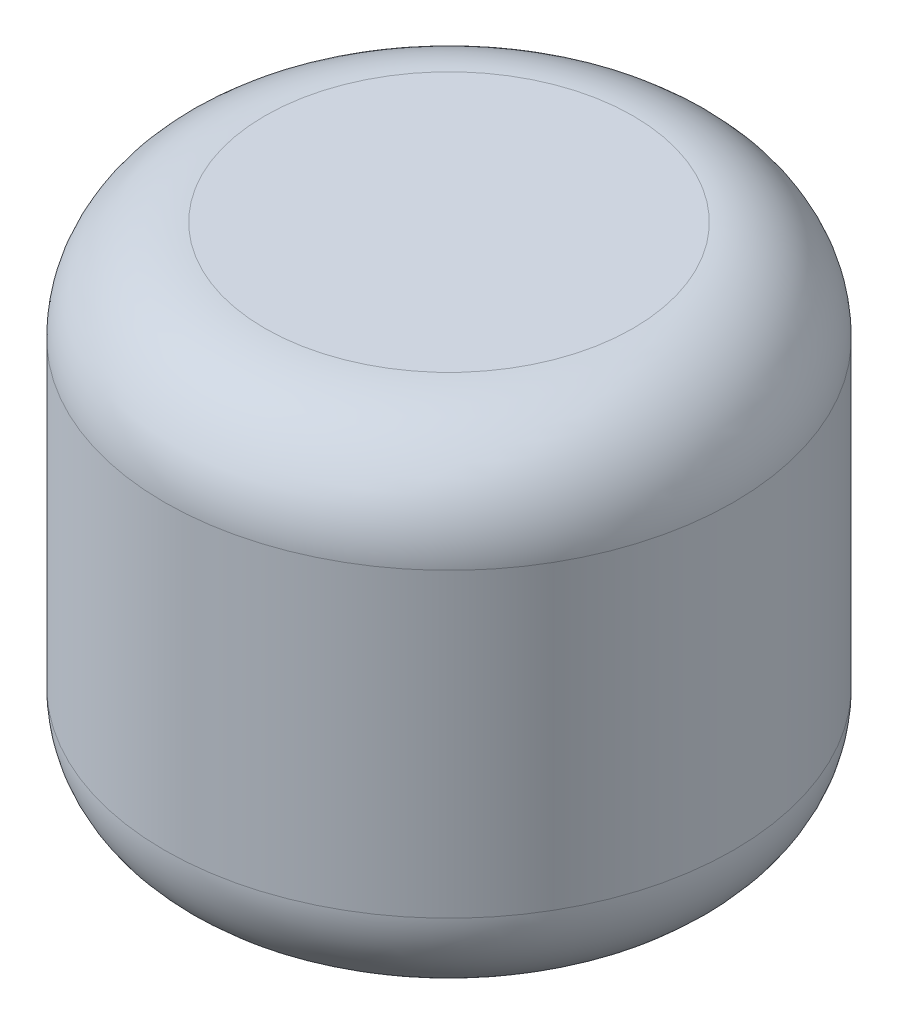
ISO-10303-21;
HEADER;
FILE_DESCRIPTION(('STEP AP214'),'2;1');
FILE_NAME('part.step','',(''),(''),'','','');
FILE_SCHEMA(('AUTOMOTIVE_DESIGN { 1 0 10303 214 1 1 1 1 }'));
ENDSEC;
DATA;
#1=APPLICATION_CONTEXT('core data for automotive mechanical design processes');
#2=APPLICATION_PROTOCOL_DEFINITION('international standard','automotive_design',2000,#1);
#3=PRODUCT_CONTEXT('',#1,'mechanical');
#4=PRODUCT('Part','Part','',(#3));
#5=PRODUCT_RELATED_PRODUCT_CATEGORY('part','',(#4));
#6=PRODUCT_DEFINITION_FORMATION('','',#4);
#7=PRODUCT_DEFINITION_CONTEXT('part definition',#1,'design');
#8=PRODUCT_DEFINITION('design','',#6,#7);
#9=PRODUCT_DEFINITION_SHAPE('','',#8);
#10=(LENGTH_UNIT() NAMED_UNIT(*) SI_UNIT(.MILLI.,.METRE.));
#11=(NAMED_UNIT(*) PLANE_ANGLE_UNIT() SI_UNIT($,.RADIAN.));
#12=(NAMED_UNIT(*) SI_UNIT($,.STERADIAN.) SOLID_ANGLE_UNIT());
#13=UNCERTAINTY_MEASURE_WITH_UNIT(LENGTH_MEASURE(1.E-05),#10,'distance_accuracy_value','');
#14=(GEOMETRIC_REPRESENTATION_CONTEXT(3) GLOBAL_UNCERTAINTY_ASSIGNED_CONTEXT((#13)) GLOBAL_UNIT_ASSIGNED_CONTEXT((#10,
#11,#12)) REPRESENTATION_CONTEXT('',''));
#15=CARTESIAN_POINT('',(0.,0.,0.));
#16=DIRECTION('',(0.,0.,1.));
#17=DIRECTION('',(1.,0.,0.));
#18=AXIS2_PLACEMENT_3D('',#15,#16,#17);
#19=CARTESIAN_POINT('',(0.,15.,0.));
#20=DIRECTION('',(0.,-1.,0.));
#21=DIRECTION('',(0.,0.,-1.));
#22=AXIS2_PLACEMENT_3D('',#19,#20,#21);
#23=CYLINDRICAL_SURFACE('',#22,8.5);
#24=CARTESIAN_POINT('',(0.,3.,0.));
#25=DIRECTION('',(0.,1.,0.));
#26=DIRECTION('',(0.,0.,1.));
#27=AXIS2_PLACEMENT_3D('',#24,#25,#26);
#28=CIRCLE('',#27,8.5);
#29=CARTESIAN_POINT('',(0.,3.,8.5));
#30=VERTEX_POINT('',#29);
#31=EDGE_CURVE('E44',#30,#30,#28,.T.);
#32=ORIENTED_EDGE('',*,*,#31,.T.);
#33=EDGE_LOOP('',(#32));
#34=FACE_BOUND('',#33,.T.);
#35=CARTESIAN_POINT('',(0.,12.,0.));
#36=DIRECTION('',(0.,1.,0.));
#37=DIRECTION('',(0.,0.,1.));
#38=AXIS2_PLACEMENT_3D('',#35,#36,#37);
#39=CIRCLE('',#38,8.5);
#40=CARTESIAN_POINT('',(0.,12.,8.5));
#41=VERTEX_POINT('',#40);
#42=EDGE_CURVE('E48',#41,#41,#39,.F.);
#43=ORIENTED_EDGE('',*,*,#42,.T.);
#44=EDGE_LOOP('',(#43));
#45=FACE_BOUND('',#44,.T.);
#46=ADVANCED_FACE('F33',(#34,#45),#23,.T.);
#47=CARTESIAN_POINT('',(0.,15.,0.));
#48=DIRECTION('',(0.,1.,0.));
#49=DIRECTION('',(0.,0.,1.));
#50=AXIS2_PLACEMENT_3D('',#47,#48,#49);
#51=PLANE('',#50);
#52=CARTESIAN_POINT('',(0.,15.,0.));
#53=DIRECTION('',(0.,1.,0.));
#54=DIRECTION('',(0.,0.,1.));
#55=AXIS2_PLACEMENT_3D('',#52,#53,#54);
#56=CIRCLE('',#55,5.5);
#57=CARTESIAN_POINT('',(0.,15.,5.5));
#58=VERTEX_POINT('',#57);
#59=EDGE_CURVE('E10',#58,#58,#56,.T.);
#60=ORIENTED_EDGE('',*,*,#59,.T.);
#61=EDGE_LOOP('',(#60));
#62=FACE_BOUND('',#61,.T.);
#63=ADVANCED_FACE('F70',(#62),#51,.T.);
#64=CARTESIAN_POINT('',(0.,0.,0.));
#65=DIRECTION('',(0.,1.,0.));
#66=DIRECTION('',(0.,0.,1.));
#67=AXIS2_PLACEMENT_3D('',#64,#65,#66);
#68=PLANE('',#67);
#69=CARTESIAN_POINT('',(0.,0.,0.));
#70=DIRECTION('',(0.,1.,0.));
#71=DIRECTION('',(0.,0.,1.));
#72=AXIS2_PLACEMENT_3D('',#69,#70,#71);
#73=CIRCLE('',#72,5.5);
#74=CARTESIAN_POINT('',(0.,0.,5.5));
#75=VERTEX_POINT('',#74);
#76=EDGE_CURVE('E40',#75,#75,#73,.F.);
#77=ORIENTED_EDGE('',*,*,#76,.T.);
#78=EDGE_LOOP('',(#77));
#79=FACE_BOUND('',#78,.T.);
#80=CARTESIAN_POINT('',(0.,0.,0.));
#81=DIRECTION('',(0.,-1.,0.));
#82=DIRECTION('',(0.,0.,-1.));
#83=AXIS2_PLACEMENT_3D('',#80,#81,#82);
#84=CIRCLE('',#83,3.5);
#85=CARTESIAN_POINT('',(0.,0.,-3.5));
#86=VERTEX_POINT('',#85);
#87=EDGE_CURVE('E54',#86,#86,#84,.T.);
#88=ORIENTED_EDGE('',*,*,#87,.F.);
#89=EDGE_LOOP('',(#88));
#90=FACE_BOUND('',#89,.T.);
#91=ADVANCED_FACE('F65',(#79,#90),#68,.F.);
#92=CARTESIAN_POINT('',(0.,10.,0.));
#93=DIRECTION('',(0.,-1.,0.));
#94=DIRECTION('',(0.,0.,-1.));
#95=AXIS2_PLACEMENT_3D('',#92,#93,#94);
#96=CYLINDRICAL_SURFACE('',#95,3.5);
#97=CARTESIAN_POINT('',(0.,10.,0.));
#98=DIRECTION('',(0.,-1.,0.));
#99=DIRECTION('',(0.,0.,-1.));
#100=AXIS2_PLACEMENT_3D('',#97,#98,#99);
#101=CIRCLE('',#100,3.5);
#102=CARTESIAN_POINT('',(0.,10.,-3.5));
#103=VERTEX_POINT('',#102);
#104=EDGE_CURVE('E53',#103,#103,#101,.T.);
#105=ORIENTED_EDGE('',*,*,#104,.F.);
#106=EDGE_LOOP('',(#105));
#107=FACE_BOUND('',#106,.T.);
#108=ORIENTED_EDGE('',*,*,#87,.T.);
#109=EDGE_LOOP('',(#108));
#110=FACE_BOUND('',#109,.T.);
#111=ADVANCED_FACE('F62',(#107,#110),#96,.F.);
#112=CARTESIAN_POINT('',(0.,10.,0.));
#113=DIRECTION('',(0.,-1.,0.));
#114=DIRECTION('',(0.,0.,-1.));
#115=AXIS2_PLACEMENT_3D('',#112,#113,#114);
#116=PLANE('',#115);
#117=ORIENTED_EDGE('',*,*,#104,.T.);
#118=EDGE_LOOP('',(#117));
#119=FACE_BOUND('',#118,.T.);
#120=ADVANCED_FACE('F60',(#119),#116,.T.);
#121=CARTESIAN_POINT('',(0.,3.,0.));
#122=DIRECTION('',(0.,1.,0.));
#123=DIRECTION('',(0.,0.,1.));
#124=AXIS2_PLACEMENT_3D('',#121,#122,#123);
#125=TOROIDAL_SURFACE('',#124,5.5,3.);
#126=ORIENTED_EDGE('',*,*,#76,.F.);
#127=EDGE_LOOP('',(#126));
#128=FACE_BOUND('',#127,.T.);
#129=ORIENTED_EDGE('',*,*,#31,.F.);
#130=EDGE_LOOP('',(#129));
#131=FACE_BOUND('',#130,.T.);
#132=ADVANCED_FACE('F82',(#128,#131),#125,.T.);
#133=CARTESIAN_POINT('',(0.,12.,0.));
#134=DIRECTION('',(0.,1.,0.));
#135=DIRECTION('',(0.,0.,1.));
#136=AXIS2_PLACEMENT_3D('',#133,#134,#135);
#137=TOROIDAL_SURFACE('',#136,5.5,3.);
#138=ORIENTED_EDGE('',*,*,#42,.F.);
#139=EDGE_LOOP('',(#138));
#140=FACE_BOUND('',#139,.T.);
#141=ORIENTED_EDGE('',*,*,#59,.F.);
#142=EDGE_LOOP('',(#141));
#143=FACE_BOUND('',#142,.T.);
#144=ADVANCED_FACE('F35',(#140,#143),#137,.T.);
#145=CLOSED_SHELL('',(#46,#63,#91,#111,#120,#132,#144));
#146=MANIFOLD_SOLID_BREP('B2',#145);
#147=ADVANCED_BREP_SHAPE_REPRESENTATION('',(#18,#146),#14);
#148=SHAPE_DEFINITION_REPRESENTATION(#9,#147);
ENDSEC;
END-ISO-10303-21;
